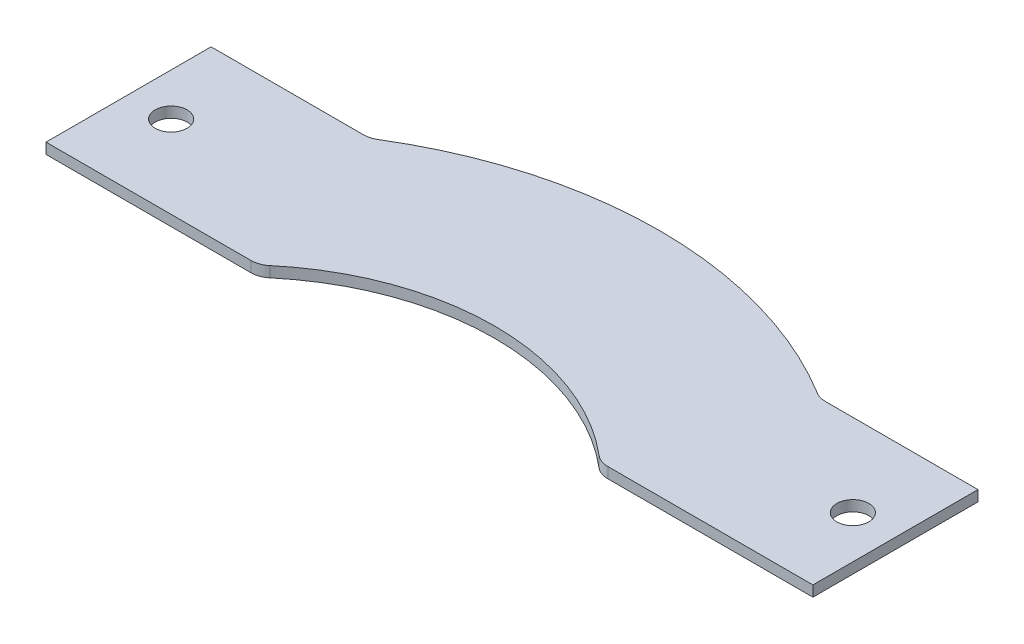
ISO-10303-21;
HEADER;
FILE_DESCRIPTION(('STEP AP214'),'2;1');
FILE_NAME('part.step','',(''),(''),'','','');
FILE_SCHEMA(('AUTOMOTIVE_DESIGN { 1 0 10303 214 1 1 1 1 }'));
ENDSEC;
DATA;
#1=APPLICATION_CONTEXT('core data for automotive mechanical design processes');
#2=APPLICATION_PROTOCOL_DEFINITION('international standard','automotive_design',2000,#1);
#3=PRODUCT_CONTEXT('',#1,'mechanical');
#4=PRODUCT('Part','Part','',(#3));
#5=PRODUCT_RELATED_PRODUCT_CATEGORY('part','',(#4));
#6=PRODUCT_DEFINITION_FORMATION('','',#4);
#7=PRODUCT_DEFINITION_CONTEXT('part definition',#1,'design');
#8=PRODUCT_DEFINITION('design','',#6,#7);
#9=PRODUCT_DEFINITION_SHAPE('','',#8);
#10=(LENGTH_UNIT() NAMED_UNIT(*) SI_UNIT(.MILLI.,.METRE.));
#11=(NAMED_UNIT(*) PLANE_ANGLE_UNIT() SI_UNIT($,.RADIAN.));
#12=(NAMED_UNIT(*) SI_UNIT($,.STERADIAN.) SOLID_ANGLE_UNIT());
#13=UNCERTAINTY_MEASURE_WITH_UNIT(LENGTH_MEASURE(1.E-05),#10,'distance_accuracy_value','');
#14=(GEOMETRIC_REPRESENTATION_CONTEXT(3) GLOBAL_UNCERTAINTY_ASSIGNED_CONTEXT((#13)) GLOBAL_UNIT_ASSIGNED_CONTEXT((#10,
#11,#12)) REPRESENTATION_CONTEXT('',''));
#15=CARTESIAN_POINT('',(0.,0.,0.));
#16=DIRECTION('',(0.,0.,1.));
#17=DIRECTION('',(1.,0.,0.));
#18=AXIS2_PLACEMENT_3D('',#15,#16,#17);
#19=CARTESIAN_POINT('',(-213.852138518055,3.175,-56.7961266284946));
#20=DIRECTION('',(0.,0.,1.));
#21=DIRECTION('',(1.,0.,0.));
#22=AXIS2_PLACEMENT_3D('',#19,#20,#21);
#23=PLANE('',#22);
#24=DIRECTION('',(-1.,0.,0.));
#25=VECTOR('',#24,1.);
#26=CARTESIAN_POINT('',(-213.852138518055,0.,-56.7961266284946));
#27=LINE('',#26,#25);
#28=CARTESIAN_POINT('',(-53.1701908198392,0.,-56.7961266284946));
#29=VERTEX_POINT('',#28);
#30=CARTESIAN_POINT('',(-114.3,0.,-56.7961266284946));
#31=VERTEX_POINT('',#30);
#32=EDGE_CURVE('E180',#29,#31,#27,.T.);
#33=ORIENTED_EDGE('',*,*,#32,.F.);
#34=DIRECTION('',(0.,-1.,0.));
#35=VECTOR('',#34,1.);
#36=CARTESIAN_POINT('',(-53.1701908198392,3.175,-56.7961266284946));
#37=LINE('',#36,#35);
#38=CARTESIAN_POINT('',(-53.1701908198392,3.175,-56.7961266284946));
#39=VERTEX_POINT('',#38);
#40=EDGE_CURVE('E11',#39,#29,#37,.T.);
#41=ORIENTED_EDGE('',*,*,#40,.F.);
#42=DIRECTION('',(-1.,0.,0.));
#43=VECTOR('',#42,1.);
#44=CARTESIAN_POINT('',(-213.852138518055,3.175,-56.7961266284946));
#45=LINE('',#44,#43);
#46=CARTESIAN_POINT('',(-114.3,3.175,-56.7961266284946));
#47=VERTEX_POINT('',#46);
#48=EDGE_CURVE('E279',#39,#47,#45,.T.);
#49=ORIENTED_EDGE('',*,*,#48,.T.);
#50=DIRECTION('',(0.,-1.,0.));
#51=VECTOR('',#50,1.);
#52=CARTESIAN_POINT('',(-114.3,3.175,-56.7961266284946));
#53=LINE('',#52,#51);
#54=EDGE_CURVE('E51',#47,#31,#53,.T.);
#55=ORIENTED_EDGE('',*,*,#54,.T.);
#56=EDGE_LOOP('',(#33,#41,#49,#55));
#57=FACE_BOUND('',#56,.T.);
#58=ADVANCED_FACE('F34',(#57),#23,.T.);
#59=CARTESIAN_POINT('',(-53.1701908198392,3.175,-63.1461266284946));
#60=DIRECTION('',(0.,-1.,0.));
#61=DIRECTION('',(0.,0.,-1.));
#62=AXIS2_PLACEMENT_3D('',#59,#60,#61);
#63=CYLINDRICAL_SURFACE('',#62,6.34999999999999);
#64=CARTESIAN_POINT('',(-53.1701908198392,0.,-63.1461266284946));
#65=DIRECTION('',(0.,1.,0.));
#66=DIRECTION('',(0.,0.,1.));
#67=AXIS2_PLACEMENT_3D('',#64,#65,#66);
#68=CIRCLE('',#67,6.34999999999999);
#69=CARTESIAN_POINT('',(-49.0801761413901,0.,-58.2887322724566));
#70=VERTEX_POINT('',#69);
#71=EDGE_CURVE('E177',#29,#70,#68,.T.);
#72=ORIENTED_EDGE('',*,*,#71,.T.);
#73=DIRECTION('',(0.,-1.,0.));
#74=VECTOR('',#73,1.);
#75=CARTESIAN_POINT('',(-49.0801761413901,3.175,-58.2887322724566));
#76=LINE('',#75,#74);
#77=CARTESIAN_POINT('',(-49.0801761413901,3.175,-58.2887322724566));
#78=VERTEX_POINT('',#77);
#79=EDGE_CURVE('E43',#78,#70,#76,.T.);
#80=ORIENTED_EDGE('',*,*,#79,.F.);
#81=CARTESIAN_POINT('',(-53.1701908198392,3.175,-63.1461266284946));
#82=DIRECTION('',(0.,1.,0.));
#83=DIRECTION('',(0.,0.,1.));
#84=AXIS2_PLACEMENT_3D('',#81,#82,#83);
#85=CIRCLE('',#84,6.34999999999999);
#86=EDGE_CURVE('E281',#39,#78,#85,.T.);
#87=ORIENTED_EDGE('',*,*,#86,.F.);
#88=ORIENTED_EDGE('',*,*,#40,.T.);
#89=EDGE_LOOP('',(#72,#80,#87,#88));
#90=FACE_BOUND('',#89,.T.);
#91=ADVANCED_FACE('F178',(#90),#63,.T.);
#92=CARTESIAN_POINT('',(0.,3.175,0.));
#93=DIRECTION('',(0.,-1.,0.));
#94=DIRECTION('',(0.,0.,-1.));
#95=AXIS2_PLACEMENT_3D('',#92,#93,#94);
#96=CYLINDRICAL_SURFACE('',#95,76.2);
#97=CARTESIAN_POINT('',(0.,0.,0.));
#98=DIRECTION('',(0.,1.,0.));
#99=DIRECTION('',(0.,0.,1.));
#100=AXIS2_PLACEMENT_3D('',#97,#98,#99);
#101=CIRCLE('',#100,76.2);
#102=CARTESIAN_POINT('',(49.08017614139,0.,-58.2887322724566));
#103=VERTEX_POINT('',#102);
#104=EDGE_CURVE('E171',#70,#103,#101,.F.);
#105=ORIENTED_EDGE('',*,*,#104,.T.);
#106=DIRECTION('',(0.,-1.,0.));
#107=VECTOR('',#106,1.);
#108=CARTESIAN_POINT('',(49.08017614139,3.175,-58.2887322724566));
#109=LINE('',#108,#107);
#110=CARTESIAN_POINT('',(49.08017614139,3.175,-58.2887322724566));
#111=VERTEX_POINT('',#110);
#112=EDGE_CURVE('E163',#111,#103,#109,.T.);
#113=ORIENTED_EDGE('',*,*,#112,.F.);
#114=CARTESIAN_POINT('',(0.,3.175,0.));
#115=DIRECTION('',(0.,1.,0.));
#116=DIRECTION('',(0.,0.,1.));
#117=AXIS2_PLACEMENT_3D('',#114,#115,#116);
#118=CIRCLE('',#117,76.2);
#119=EDGE_CURVE('E173',#78,#111,#118,.F.);
#120=ORIENTED_EDGE('',*,*,#119,.F.);
#121=ORIENTED_EDGE('',*,*,#79,.T.);
#122=EDGE_LOOP('',(#105,#113,#120,#121));
#123=FACE_BOUND('',#122,.T.);
#124=ADVANCED_FACE('F169',(#123),#96,.F.);
#125=CARTESIAN_POINT('',(53.1701908198392,3.175,-63.1461266284947));
#126=DIRECTION('',(0.,-1.,0.));
#127=DIRECTION('',(0.,0.,-1.));
#128=AXIS2_PLACEMENT_3D('',#125,#126,#127);
#129=CYLINDRICAL_SURFACE('',#128,6.35);
#130=CARTESIAN_POINT('',(53.1701908198392,0.,-63.1461266284947));
#131=DIRECTION('',(0.,1.,0.));
#132=DIRECTION('',(0.,0.,1.));
#133=AXIS2_PLACEMENT_3D('',#130,#131,#132);
#134=CIRCLE('',#133,6.35);
#135=CARTESIAN_POINT('',(53.1701908198392,0.,-56.7961266284947));
#136=VERTEX_POINT('',#135);
#137=EDGE_CURVE('E182',#136,#103,#134,.F.);
#138=ORIENTED_EDGE('',*,*,#137,.F.);
#139=DIRECTION('',(0.,-1.,0.));
#140=VECTOR('',#139,1.);
#141=CARTESIAN_POINT('',(53.1701908198392,3.175,-56.7961266284947));
#142=LINE('',#141,#140);
#143=CARTESIAN_POINT('',(53.1701908198392,3.175,-56.7961266284947));
#144=VERTEX_POINT('',#143);
#145=EDGE_CURVE('E161',#144,#136,#142,.T.);
#146=ORIENTED_EDGE('',*,*,#145,.F.);
#147=CARTESIAN_POINT('',(53.1701908198392,3.175,-63.1461266284947));
#148=DIRECTION('',(0.,1.,0.));
#149=DIRECTION('',(0.,0.,1.));
#150=AXIS2_PLACEMENT_3D('',#147,#148,#149);
#151=CIRCLE('',#150,6.35);
#152=EDGE_CURVE('E287',#144,#111,#151,.F.);
#153=ORIENTED_EDGE('',*,*,#152,.T.);
#154=ORIENTED_EDGE('',*,*,#112,.T.);
#155=EDGE_LOOP('',(#138,#146,#153,#154));
#156=FACE_BOUND('',#155,.T.);
#157=ADVANCED_FACE('F239',(#156),#129,.T.);
#158=CARTESIAN_POINT('',(-213.852138518055,3.175,-56.7961266284946));
#159=DIRECTION('',(0.,0.,1.));
#160=DIRECTION('',(1.,0.,0.));
#161=AXIS2_PLACEMENT_3D('',#158,#159,#160);
#162=PLANE('',#161);
#163=DIRECTION('',(-1.,0.,0.));
#164=VECTOR('',#163,1.);
#165=CARTESIAN_POINT('',(-213.852138518055,0.,-56.7961266284946));
#166=LINE('',#165,#164);
#167=CARTESIAN_POINT('',(114.3,0.,-56.7961266284947));
#168=VERTEX_POINT('',#167);
#169=EDGE_CURVE('E189',#168,#136,#166,.T.);
#170=ORIENTED_EDGE('',*,*,#169,.F.);
#171=DIRECTION('',(0.,-1.,0.));
#172=VECTOR('',#171,1.);
#173=CARTESIAN_POINT('',(114.3,3.175,-56.7961266284947));
#174=LINE('',#173,#172);
#175=CARTESIAN_POINT('',(114.3,3.175,-56.7961266284947));
#176=VERTEX_POINT('',#175);
#177=EDGE_CURVE('E159',#176,#168,#174,.T.);
#178=ORIENTED_EDGE('',*,*,#177,.F.);
#179=DIRECTION('',(-1.,0.,0.));
#180=VECTOR('',#179,1.);
#181=CARTESIAN_POINT('',(-213.852138518055,3.175,-56.7961266284946));
#182=LINE('',#181,#180);
#183=EDGE_CURVE('E290',#176,#144,#182,.T.);
#184=ORIENTED_EDGE('',*,*,#183,.T.);
#185=ORIENTED_EDGE('',*,*,#145,.T.);
#186=EDGE_LOOP('',(#170,#178,#184,#185));
#187=FACE_BOUND('',#186,.T.);
#188=ADVANCED_FACE('F242',(#187),#162,.T.);
#189=CARTESIAN_POINT('',(114.3,3.175,-76.7632726606404));
#190=DIRECTION('',(-1.,0.,0.));
#191=DIRECTION('',(0.,0.,1.));
#192=AXIS2_PLACEMENT_3D('',#189,#190,#191);
#193=PLANE('',#192);
#194=DIRECTION('',(0.,0.,-1.));
#195=VECTOR('',#194,1.);
#196=CARTESIAN_POINT('',(114.3,0.,-76.7632726606404));
#197=LINE('',#196,#195);
#198=CARTESIAN_POINT('',(114.3,0.,-106.008626628495));
#199=VERTEX_POINT('',#198);
#200=EDGE_CURVE('E192',#168,#199,#197,.T.);
#201=ORIENTED_EDGE('',*,*,#200,.T.);
#202=DIRECTION('',(0.,-1.,0.));
#203=VECTOR('',#202,1.);
#204=CARTESIAN_POINT('',(114.3,3.175,-106.008626628495));
#205=LINE('',#204,#203);
#206=CARTESIAN_POINT('',(114.3,3.175,-106.008626628495));
#207=VERTEX_POINT('',#206);
#208=EDGE_CURVE('E157',#207,#199,#205,.T.);
#209=ORIENTED_EDGE('',*,*,#208,.F.);
#210=DIRECTION('',(0.,0.,-1.));
#211=VECTOR('',#210,1.);
#212=CARTESIAN_POINT('',(114.3,3.175,-76.7632726606404));
#213=LINE('',#212,#211);
#214=EDGE_CURVE('E293',#176,#207,#213,.T.);
#215=ORIENTED_EDGE('',*,*,#214,.F.);
#216=ORIENTED_EDGE('',*,*,#177,.T.);
#217=EDGE_LOOP('',(#201,#209,#215,#216));
#218=FACE_BOUND('',#217,.T.);
#219=ADVANCED_FACE('F246',(#218),#193,.F.);
#220=CARTESIAN_POINT('',(-213.852138518055,3.175,-106.008626628495));
#221=DIRECTION('',(0.,0.,-1.));
#222=DIRECTION('',(-1.,0.,0.));
#223=AXIS2_PLACEMENT_3D('',#220,#221,#222);
#224=PLANE('',#223);
#225=DIRECTION('',(1.,0.,0.));
#226=VECTOR('',#225,1.);
#227=CARTESIAN_POINT('',(-213.852138518055,0.,-106.008626628495));
#228=LINE('',#227,#226);
#229=CARTESIAN_POINT('',(68.8251075437483,0.,-106.008626628495));
#230=VERTEX_POINT('',#229);
#231=EDGE_CURVE('E195',#230,#199,#228,.T.);
#232=ORIENTED_EDGE('',*,*,#231,.F.);
#233=DIRECTION('',(0.,-1.,0.));
#234=VECTOR('',#233,1.);
#235=CARTESIAN_POINT('',(68.8251075437483,3.175,-106.008626628495));
#236=LINE('',#235,#234);
#237=CARTESIAN_POINT('',(68.8251075437483,3.175,-106.008626628495));
#238=VERTEX_POINT('',#237);
#239=EDGE_CURVE('E155',#238,#230,#236,.T.);
#240=ORIENTED_EDGE('',*,*,#239,.F.);
#241=DIRECTION('',(1.,0.,0.));
#242=VECTOR('',#241,1.);
#243=CARTESIAN_POINT('',(-213.852138518055,3.175,-106.008626628495));
#244=LINE('',#243,#242);
#245=EDGE_CURVE('E295',#238,#207,#244,.T.);
#246=ORIENTED_EDGE('',*,*,#245,.T.);
#247=ORIENTED_EDGE('',*,*,#208,.T.);
#248=EDGE_LOOP('',(#232,#240,#246,#247));
#249=FACE_BOUND('',#248,.T.);
#250=ADVANCED_FACE('F250',(#249),#224,.T.);
#251=CARTESIAN_POINT('',(68.8251075437484,3.175,-112.358626628495));
#252=DIRECTION('',(0.,-1.,0.));
#253=DIRECTION('',(0.,0.,-1.));
#254=AXIS2_PLACEMENT_3D('',#251,#252,#253);
#255=CYLINDRICAL_SURFACE('',#254,6.34999999999999);
#256=CARTESIAN_POINT('',(68.8251075437484,0.,-112.358626628495));
#257=DIRECTION('',(0.,1.,0.));
#258=DIRECTION('',(0.,0.,1.));
#259=AXIS2_PLACEMENT_3D('',#256,#257,#258);
#260=CIRCLE('',#259,6.34999999999999);
#261=CARTESIAN_POINT('',(65.5082348910376,0.,-106.943753056037));
#262=VERTEX_POINT('',#261);
#263=EDGE_CURVE('E198',#230,#262,#260,.F.);
#264=ORIENTED_EDGE('',*,*,#263,.T.);
#265=DIRECTION('',(0.,-1.,0.));
#266=VECTOR('',#265,1.);
#267=CARTESIAN_POINT('',(65.5082348910376,3.175,-106.943753056037));
#268=LINE('',#267,#266);
#269=CARTESIAN_POINT('',(65.5082348910376,3.175,-106.943753056037));
#270=VERTEX_POINT('',#269);
#271=EDGE_CURVE('E149',#270,#262,#268,.T.);
#272=ORIENTED_EDGE('',*,*,#271,.F.);
#273=CARTESIAN_POINT('',(68.8251075437484,3.175,-112.358626628495));
#274=DIRECTION('',(0.,1.,0.));
#275=DIRECTION('',(0.,0.,1.));
#276=AXIS2_PLACEMENT_3D('',#273,#274,#275);
#277=CIRCLE('',#276,6.34999999999999);
#278=EDGE_CURVE('E298',#238,#270,#277,.F.);
#279=ORIENTED_EDGE('',*,*,#278,.F.);
#280=ORIENTED_EDGE('',*,*,#239,.T.);
#281=EDGE_LOOP('',(#264,#272,#279,#280));
#282=FACE_BOUND('',#281,.T.);
#283=ADVANCED_FACE('F254',(#282),#255,.F.);
#284=CARTESIAN_POINT('',(0.,3.175,0.));
#285=DIRECTION('',(0.,-1.,0.));
#286=DIRECTION('',(0.,0.,-1.));
#287=AXIS2_PLACEMENT_3D('',#284,#285,#286);
#288=CYLINDRICAL_SURFACE('',#287,125.4125);
#289=CARTESIAN_POINT('',(0.,0.,0.));
#290=DIRECTION('',(0.,1.,0.));
#291=DIRECTION('',(0.,0.,1.));
#292=AXIS2_PLACEMENT_3D('',#289,#290,#291);
#293=CIRCLE('',#292,125.4125);
#294=CARTESIAN_POINT('',(-65.5082348910377,0.,-106.943753056037));
#295=VERTEX_POINT('',#294);
#296=EDGE_CURVE('E201',#295,#262,#293,.F.);
#297=ORIENTED_EDGE('',*,*,#296,.F.);
#298=DIRECTION('',(0.,-1.,0.));
#299=VECTOR('',#298,1.);
#300=CARTESIAN_POINT('',(-65.5082348910377,3.175,-106.943753056037));
#301=LINE('',#300,#299);
#302=CARTESIAN_POINT('',(-65.5082348910377,3.175,-106.943753056037));
#303=VERTEX_POINT('',#302);
#304=EDGE_CURVE('E147',#303,#295,#301,.T.);
#305=ORIENTED_EDGE('',*,*,#304,.F.);
#306=CARTESIAN_POINT('',(0.,3.175,0.));
#307=DIRECTION('',(0.,1.,0.));
#308=DIRECTION('',(0.,0.,1.));
#309=AXIS2_PLACEMENT_3D('',#306,#307,#308);
#310=CIRCLE('',#309,125.4125);
#311=EDGE_CURVE('E141',#303,#270,#310,.F.);
#312=ORIENTED_EDGE('',*,*,#311,.T.);
#313=ORIENTED_EDGE('',*,*,#271,.T.);
#314=EDGE_LOOP('',(#297,#305,#312,#313));
#315=FACE_BOUND('',#314,.T.);
#316=ADVANCED_FACE('F258',(#315),#288,.T.);
#317=CARTESIAN_POINT('',(-68.8251075437484,3.175,-112.358626628495));
#318=DIRECTION('',(0.,-1.,0.));
#319=DIRECTION('',(0.,0.,-1.));
#320=AXIS2_PLACEMENT_3D('',#317,#318,#319);
#321=CYLINDRICAL_SURFACE('',#320,6.35);
#322=CARTESIAN_POINT('',(-68.8251075437484,0.,-112.358626628495));
#323=DIRECTION('',(0.,1.,0.));
#324=DIRECTION('',(0.,0.,1.));
#325=AXIS2_PLACEMENT_3D('',#322,#323,#324);
#326=CIRCLE('',#325,6.35);
#327=CARTESIAN_POINT('',(-68.8251075437484,0.,-106.008626628495));
#328=VERTEX_POINT('',#327);
#329=EDGE_CURVE('E146',#295,#328,#326,.F.);
#330=ORIENTED_EDGE('',*,*,#329,.T.);
#331=DIRECTION('',(0.,-1.,0.));
#332=VECTOR('',#331,1.);
#333=CARTESIAN_POINT('',(-68.8251075437484,3.175,-106.008626628495));
#334=LINE('',#333,#332);
#335=CARTESIAN_POINT('',(-68.8251075437484,3.175,-106.008626628495));
#336=VERTEX_POINT('',#335);
#337=EDGE_CURVE('E129',#336,#328,#334,.T.);
#338=ORIENTED_EDGE('',*,*,#337,.F.);
#339=CARTESIAN_POINT('',(-68.8251075437484,3.175,-112.358626628495));
#340=DIRECTION('',(0.,1.,0.));
#341=DIRECTION('',(0.,0.,1.));
#342=AXIS2_PLACEMENT_3D('',#339,#340,#341);
#343=CIRCLE('',#342,6.35);
#344=EDGE_CURVE('E134',#303,#336,#343,.F.);
#345=ORIENTED_EDGE('',*,*,#344,.F.);
#346=ORIENTED_EDGE('',*,*,#304,.T.);
#347=EDGE_LOOP('',(#330,#338,#345,#346));
#348=FACE_BOUND('',#347,.T.);
#349=ADVANCED_FACE('F144',(#348),#321,.F.);
#350=CARTESIAN_POINT('',(-213.852138518055,3.175,-106.008626628495));
#351=DIRECTION('',(0.,0.,1.));
#352=DIRECTION('',(1.,0.,0.));
#353=AXIS2_PLACEMENT_3D('',#350,#351,#352);
#354=PLANE('',#353);
#355=DIRECTION('',(-1.,0.,0.));
#356=VECTOR('',#355,1.);
#357=CARTESIAN_POINT('',(-213.852138518055,0.,-106.008626628495));
#358=LINE('',#357,#356);
#359=CARTESIAN_POINT('',(-114.3,0.,-106.008626628495));
#360=VERTEX_POINT('',#359);
#361=EDGE_CURVE('E205',#328,#360,#358,.T.);
#362=ORIENTED_EDGE('',*,*,#361,.T.);
#363=DIRECTION('',(0.,-1.,0.));
#364=VECTOR('',#363,1.);
#365=CARTESIAN_POINT('',(-114.3,3.175,-106.008626628495));
#366=LINE('',#365,#364);
#367=CARTESIAN_POINT('',(-114.3,3.175,-106.008626628495));
#368=VERTEX_POINT('',#367);
#369=EDGE_CURVE('E89',#368,#360,#366,.T.);
#370=ORIENTED_EDGE('',*,*,#369,.F.);
#371=DIRECTION('',(-1.,0.,0.));
#372=VECTOR('',#371,1.);
#373=CARTESIAN_POINT('',(-213.852138518055,3.175,-106.008626628495));
#374=LINE('',#373,#372);
#375=EDGE_CURVE('E125',#336,#368,#374,.T.);
#376=ORIENTED_EDGE('',*,*,#375,.F.);
#377=ORIENTED_EDGE('',*,*,#337,.T.);
#378=EDGE_LOOP('',(#362,#370,#376,#377));
#379=FACE_BOUND('',#378,.T.);
#380=ADVANCED_FACE('F127',(#379),#354,.F.);
#381=CARTESIAN_POINT('',(-101.6,3.175,-81.4023766284947));
#382=DIRECTION('',(0.,-1.,0.));
#383=DIRECTION('',(0.,0.,-1.));
#384=AXIS2_PLACEMENT_3D('',#381,#382,#383);
#385=CYLINDRICAL_SURFACE('',#384,4.7625);
#386=CARTESIAN_POINT('',(-101.6,3.175,-81.4023766284947));
#387=DIRECTION('',(0.,1.,0.));
#388=DIRECTION('',(0.,0.,1.));
#389=AXIS2_PLACEMENT_3D('',#386,#387,#388);
#390=CIRCLE('',#389,4.7625);
#391=CARTESIAN_POINT('',(-101.6,3.175,-76.6398766284946));
#392=VERTEX_POINT('',#391);
#393=EDGE_CURVE('E278',#392,#392,#390,.T.);
#394=ORIENTED_EDGE('',*,*,#393,.T.);
#395=EDGE_LOOP('',(#394));
#396=FACE_BOUND('',#395,.T.);
#397=CARTESIAN_POINT('',(-101.6,0.,-81.4023766284947));
#398=DIRECTION('',(0.,1.,0.));
#399=DIRECTION('',(0.,0.,1.));
#400=AXIS2_PLACEMENT_3D('',#397,#398,#399);
#401=CIRCLE('',#400,4.7625);
#402=CARTESIAN_POINT('',(-101.6,0.,-76.6398766284946));
#403=VERTEX_POINT('',#402);
#404=EDGE_CURVE('E184',#403,#403,#401,.T.);
#405=ORIENTED_EDGE('',*,*,#404,.F.);
#406=EDGE_LOOP('',(#405));
#407=FACE_BOUND('',#406,.T.);
#408=ADVANCED_FACE('F219',(#396,#407),#385,.F.);
#409=CARTESIAN_POINT('',(101.6,3.175,-81.4023766284947));
#410=DIRECTION('',(0.,-1.,0.));
#411=DIRECTION('',(0.,0.,-1.));
#412=AXIS2_PLACEMENT_3D('',#409,#410,#411);
#413=CYLINDRICAL_SURFACE('',#412,4.7625);
#414=CARTESIAN_POINT('',(101.6,3.175,-81.4023766284947));
#415=DIRECTION('',(0.,1.,0.));
#416=DIRECTION('',(0.,0.,1.));
#417=AXIS2_PLACEMENT_3D('',#414,#415,#416);
#418=CIRCLE('',#417,4.7625);
#419=CARTESIAN_POINT('',(101.6,3.175,-76.6398766284947));
#420=VERTEX_POINT('',#419);
#421=EDGE_CURVE('E209',#420,#420,#418,.T.);
#422=ORIENTED_EDGE('',*,*,#421,.T.);
#423=EDGE_LOOP('',(#422));
#424=FACE_BOUND('',#423,.T.);
#425=CARTESIAN_POINT('',(101.6,0.,-81.4023766284947));
#426=DIRECTION('',(0.,1.,0.));
#427=DIRECTION('',(0.,0.,1.));
#428=AXIS2_PLACEMENT_3D('',#425,#426,#427);
#429=CIRCLE('',#428,4.7625);
#430=CARTESIAN_POINT('',(101.6,0.,-76.6398766284947));
#431=VERTEX_POINT('',#430);
#432=EDGE_CURVE('E212',#431,#431,#429,.T.);
#433=ORIENTED_EDGE('',*,*,#432,.F.);
#434=EDGE_LOOP('',(#433));
#435=FACE_BOUND('',#434,.T.);
#436=ADVANCED_FACE('F36',(#424,#435),#413,.F.);
#437=CARTESIAN_POINT('',(-114.3,3.175,-76.7632726606403));
#438=DIRECTION('',(-1.,0.,0.));
#439=DIRECTION('',(0.,0.,1.));
#440=AXIS2_PLACEMENT_3D('',#437,#438,#439);
#441=PLANE('',#440);
#442=DIRECTION('',(0.,0.,-1.));
#443=VECTOR('',#442,1.);
#444=CARTESIAN_POINT('',(-114.3,0.,-76.7632726606403));
#445=LINE('',#444,#443);
#446=EDGE_CURVE('E207',#31,#360,#445,.T.);
#447=ORIENTED_EDGE('',*,*,#446,.F.);
#448=ORIENTED_EDGE('',*,*,#54,.F.);
#449=DIRECTION('',(0.,0.,-1.));
#450=VECTOR('',#449,1.);
#451=CARTESIAN_POINT('',(-114.3,3.175,-76.7632726606403));
#452=LINE('',#451,#450);
#453=EDGE_CURVE('E133',#47,#368,#452,.T.);
#454=ORIENTED_EDGE('',*,*,#453,.T.);
#455=ORIENTED_EDGE('',*,*,#369,.T.);
#456=EDGE_LOOP('',(#447,#448,#454,#455));
#457=FACE_BOUND('',#456,.T.);
#458=ADVANCED_FACE('F226',(#457),#441,.T.);
#459=CARTESIAN_POINT('',(-213.852138518055,3.175,-76.7632726606403));
#460=DIRECTION('',(0.,1.,0.));
#461=DIRECTION('',(0.,0.,1.));
#462=AXIS2_PLACEMENT_3D('',#459,#460,#461);
#463=PLANE('',#462);
#464=ORIENTED_EDGE('',*,*,#421,.F.);
#465=EDGE_LOOP('',(#464));
#466=FACE_BOUND('',#465,.T.);
#467=ORIENTED_EDGE('',*,*,#393,.F.);
#468=EDGE_LOOP('',(#467));
#469=FACE_BOUND('',#468,.T.);
#470=ORIENTED_EDGE('',*,*,#48,.F.);
#471=ORIENTED_EDGE('',*,*,#86,.T.);
#472=ORIENTED_EDGE('',*,*,#119,.T.);
#473=ORIENTED_EDGE('',*,*,#152,.F.);
#474=ORIENTED_EDGE('',*,*,#183,.F.);
#475=ORIENTED_EDGE('',*,*,#214,.T.);
#476=ORIENTED_EDGE('',*,*,#245,.F.);
#477=ORIENTED_EDGE('',*,*,#278,.T.);
#478=ORIENTED_EDGE('',*,*,#311,.F.);
#479=ORIENTED_EDGE('',*,*,#344,.T.);
#480=ORIENTED_EDGE('',*,*,#375,.T.);
#481=ORIENTED_EDGE('',*,*,#453,.F.);
#482=EDGE_LOOP('',(#470,#471,#472,#473,#474,#475,#476,#477,#478,#479,#480,#481));
#483=FACE_BOUND('',#482,.T.);
#484=ADVANCED_FACE('F139',(#466,#469,#483),#463,.T.);
#485=CARTESIAN_POINT('',(-213.852138518055,0.,-76.7632726606403));
#486=DIRECTION('',(0.,1.,0.));
#487=DIRECTION('',(0.,0.,1.));
#488=AXIS2_PLACEMENT_3D('',#485,#486,#487);
#489=PLANE('',#488);
#490=ORIENTED_EDGE('',*,*,#432,.T.);
#491=EDGE_LOOP('',(#490));
#492=FACE_BOUND('',#491,.T.);
#493=ORIENTED_EDGE('',*,*,#404,.T.);
#494=EDGE_LOOP('',(#493));
#495=FACE_BOUND('',#494,.T.);
#496=ORIENTED_EDGE('',*,*,#32,.T.);
#497=ORIENTED_EDGE('',*,*,#446,.T.);
#498=ORIENTED_EDGE('',*,*,#361,.F.);
#499=ORIENTED_EDGE('',*,*,#329,.F.);
#500=ORIENTED_EDGE('',*,*,#296,.T.);
#501=ORIENTED_EDGE('',*,*,#263,.F.);
#502=ORIENTED_EDGE('',*,*,#231,.T.);
#503=ORIENTED_EDGE('',*,*,#200,.F.);
#504=ORIENTED_EDGE('',*,*,#169,.T.);
#505=ORIENTED_EDGE('',*,*,#137,.T.);
#506=ORIENTED_EDGE('',*,*,#104,.F.);
#507=ORIENTED_EDGE('',*,*,#71,.F.);
#508=EDGE_LOOP('',(#496,#497,#498,#499,#500,#501,#502,#503,#504,#505,#506,#507));
#509=FACE_BOUND('',#508,.T.);
#510=ADVANCED_FACE('F217',(#492,#495,#509),#489,.F.);
#511=CLOSED_SHELL('',(#58,#91,#124,#157,#188,#219,#250,#283,#316,#349,#380,#408,#436,#458,#484,#510));
#512=MANIFOLD_SOLID_BREP('B2',#511);
#513=ADVANCED_BREP_SHAPE_REPRESENTATION('',(#18,#512),#14);
#514=SHAPE_DEFINITION_REPRESENTATION(#9,#513);
ENDSEC;
END-ISO-10303-21;
